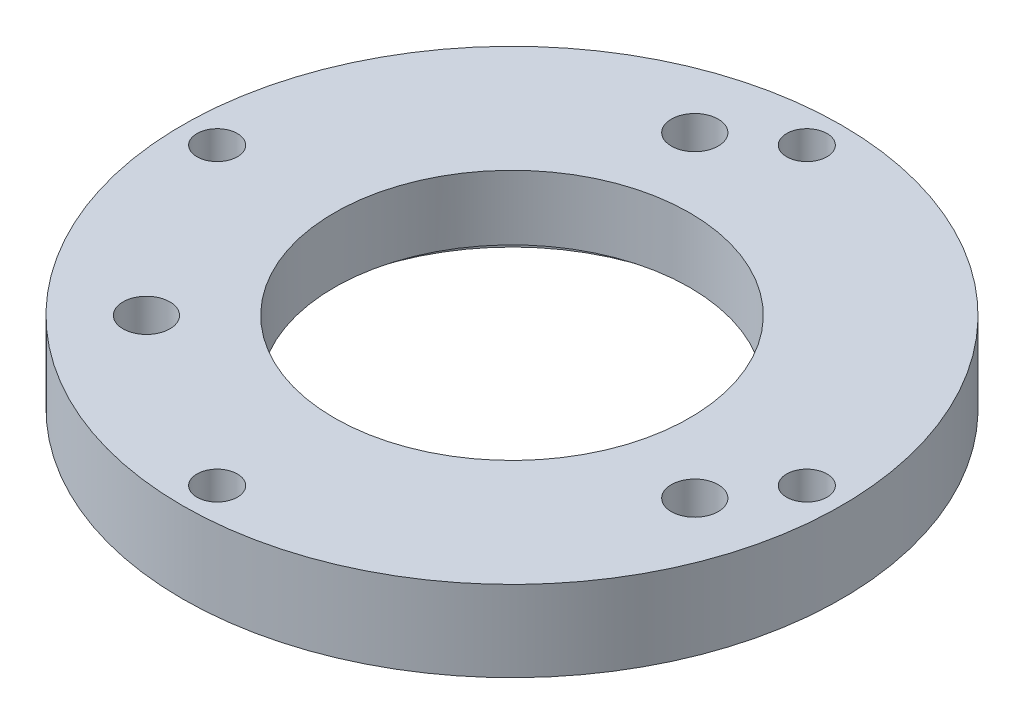
ISO-10303-21;
HEADER;
FILE_DESCRIPTION(('STEP AP214'),'2;1');
FILE_NAME('part.step','',(''),(''),'','','');
FILE_SCHEMA(('AUTOMOTIVE_DESIGN { 1 0 10303 214 1 1 1 1 }'));
ENDSEC;
DATA;
#1=APPLICATION_CONTEXT('core data for automotive mechanical design processes');
#2=APPLICATION_PROTOCOL_DEFINITION('international standard','automotive_design',2000,#1);
#3=PRODUCT_CONTEXT('',#1,'mechanical');
#4=PRODUCT('Part','Part','',(#3));
#5=PRODUCT_RELATED_PRODUCT_CATEGORY('part','',(#4));
#6=PRODUCT_DEFINITION_FORMATION('','',#4);
#7=PRODUCT_DEFINITION_CONTEXT('part definition',#1,'design');
#8=PRODUCT_DEFINITION('design','',#6,#7);
#9=PRODUCT_DEFINITION_SHAPE('','',#8);
#10=(LENGTH_UNIT() NAMED_UNIT(*) SI_UNIT(.MILLI.,.METRE.));
#11=(NAMED_UNIT(*) PLANE_ANGLE_UNIT() SI_UNIT($,.RADIAN.));
#12=(NAMED_UNIT(*) SI_UNIT($,.STERADIAN.) SOLID_ANGLE_UNIT());
#13=UNCERTAINTY_MEASURE_WITH_UNIT(LENGTH_MEASURE(1.E-05),#10,'distance_accuracy_value','');
#14=(GEOMETRIC_REPRESENTATION_CONTEXT(3) GLOBAL_UNCERTAINTY_ASSIGNED_CONTEXT((#13)) GLOBAL_UNIT_ASSIGNED_CONTEXT((#10,
#11,#12)) REPRESENTATION_CONTEXT('',''));
#15=CARTESIAN_POINT('',(0.,0.,0.));
#16=DIRECTION('',(0.,0.,1.));
#17=DIRECTION('',(1.,0.,0.));
#18=AXIS2_PLACEMENT_3D('',#15,#16,#17);
#19=CARTESIAN_POINT('',(0.,5.,0.));
#20=DIRECTION('',(0.,-1.,0.));
#21=DIRECTION('',(0.,0.,-1.));
#22=AXIS2_PLACEMENT_3D('',#19,#20,#21);
#23=CYLINDRICAL_SURFACE('',#22,11.);
#24=CARTESIAN_POINT('',(0.,5.,0.));
#25=DIRECTION('',(0.,1.,0.));
#26=DIRECTION('',(0.,0.,1.));
#27=AXIS2_PLACEMENT_3D('',#24,#25,#26);
#28=CIRCLE('',#27,11.);
#29=CARTESIAN_POINT('',(0.,5.,11.));
#30=VERTEX_POINT('',#29);
#31=EDGE_CURVE('E46',#30,#30,#28,.T.);
#32=ORIENTED_EDGE('',*,*,#31,.T.);
#33=EDGE_LOOP('',(#32));
#34=FACE_BOUND('',#33,.T.);
#35=CARTESIAN_POINT('',(0.,1.,0.));
#36=DIRECTION('',(0.,-1.,0.));
#37=DIRECTION('',(0.,0.,-1.));
#38=AXIS2_PLACEMENT_3D('',#35,#36,#37);
#39=CIRCLE('',#38,11.);
#40=CARTESIAN_POINT('',(0.,1.,-11.));
#41=VERTEX_POINT('',#40);
#42=EDGE_CURVE('E37',#41,#41,#39,.T.);
#43=ORIENTED_EDGE('',*,*,#42,.T.);
#44=EDGE_LOOP('',(#43));
#45=FACE_BOUND('',#44,.T.);
#46=ADVANCED_FACE('F33',(#34,#45),#23,.F.);
#47=CARTESIAN_POINT('',(0.,5.,0.));
#48=DIRECTION('',(0.,1.,0.));
#49=DIRECTION('',(0.,0.,1.));
#50=AXIS2_PLACEMENT_3D('',#47,#48,#49);
#51=PLANE('',#50);
#52=CARTESIAN_POINT('',(-11.3137084989848,5.,11.3137084989848));
#53=DIRECTION('',(0.,-1.,0.));
#54=DIRECTION('',(0.,0.,-1.));
#55=AXIS2_PLACEMENT_3D('',#52,#53,#54);
#56=CIRCLE('',#55,1.45);
#57=CARTESIAN_POINT('',(-11.3137084989848,5.,9.86370849898476));
#58=VERTEX_POINT('',#57);
#59=EDGE_CURVE('E98',#58,#58,#56,.T.);
#60=ORIENTED_EDGE('',*,*,#59,.T.);
#61=EDGE_LOOP('',(#60));
#62=FACE_BOUND('',#61,.T.);
#63=CARTESIAN_POINT('',(-4.14110472164031,5.,-15.4548132206251));
#64=DIRECTION('',(0.,-1.,0.));
#65=DIRECTION('',(0.,0.,-1.));
#66=AXIS2_PLACEMENT_3D('',#63,#64,#65);
#67=CIRCLE('',#66,1.45);
#68=CARTESIAN_POINT('',(-4.14110472164031,5.,-16.9048132206251));
#69=VERTEX_POINT('',#68);
#70=EDGE_CURVE('E86',#69,#69,#67,.T.);
#71=ORIENTED_EDGE('',*,*,#70,.T.);
#72=EDGE_LOOP('',(#71));
#73=FACE_BOUND('',#72,.T.);
#74=CARTESIAN_POINT('',(15.4548132206251,5.,4.14110472164043));
#75=DIRECTION('',(0.,-1.,0.));
#76=DIRECTION('',(0.,0.,-1.));
#77=AXIS2_PLACEMENT_3D('',#74,#75,#76);
#78=CIRCLE('',#77,1.45);
#79=CARTESIAN_POINT('',(15.4548132206251,5.,2.69110472164043));
#80=VERTEX_POINT('',#79);
#81=EDGE_CURVE('E74',#80,#80,#78,.T.);
#82=ORIENTED_EDGE('',*,*,#81,.T.);
#83=EDGE_LOOP('',(#82));
#84=FACE_BOUND('',#83,.T.);
#85=CARTESIAN_POINT('',(-18.25,5.,0.));
#86=DIRECTION('',(0.,1.,0.));
#87=DIRECTION('',(0.,0.,1.));
#88=AXIS2_PLACEMENT_3D('',#85,#86,#87);
#89=CIRCLE('',#88,1.24999999999999);
#90=CARTESIAN_POINT('',(-18.25,5.,1.24999999999999));
#91=VERTEX_POINT('',#90);
#92=EDGE_CURVE('E71',#91,#91,#89,.T.);
#93=ORIENTED_EDGE('',*,*,#92,.F.);
#94=EDGE_LOOP('',(#93));
#95=FACE_BOUND('',#94,.T.);
#96=CARTESIAN_POINT('',(0.,5.,-18.25));
#97=DIRECTION('',(0.,1.,0.));
#98=DIRECTION('',(0.,0.,1.));
#99=AXIS2_PLACEMENT_3D('',#96,#97,#98);
#100=CIRCLE('',#99,1.24999999999999);
#101=CARTESIAN_POINT('',(0.,5.,-17.));
#102=VERTEX_POINT('',#101);
#103=EDGE_CURVE('E65',#102,#102,#100,.T.);
#104=ORIENTED_EDGE('',*,*,#103,.F.);
#105=EDGE_LOOP('',(#104));
#106=FACE_BOUND('',#105,.T.);
#107=CARTESIAN_POINT('',(18.25,5.,0.));
#108=DIRECTION('',(0.,1.,0.));
#109=DIRECTION('',(0.,0.,1.));
#110=AXIS2_PLACEMENT_3D('',#107,#108,#109);
#111=CIRCLE('',#110,1.24999999999999);
#112=CARTESIAN_POINT('',(18.25,5.,1.24999999999999));
#113=VERTEX_POINT('',#112);
#114=EDGE_CURVE('E59',#113,#113,#111,.T.);
#115=ORIENTED_EDGE('',*,*,#114,.F.);
#116=EDGE_LOOP('',(#115));
#117=FACE_BOUND('',#116,.T.);
#118=CARTESIAN_POINT('',(0.,5.,18.25));
#119=DIRECTION('',(0.,1.,0.));
#120=DIRECTION('',(0.,0.,1.));
#121=AXIS2_PLACEMENT_3D('',#118,#119,#120);
#122=CIRCLE('',#121,1.24999999999999);
#123=CARTESIAN_POINT('',(0.,5.,19.5));
#124=VERTEX_POINT('',#123);
#125=EDGE_CURVE('E53',#124,#124,#122,.T.);
#126=ORIENTED_EDGE('',*,*,#125,.F.);
#127=EDGE_LOOP('',(#126));
#128=FACE_BOUND('',#127,.T.);
#129=CARTESIAN_POINT('',(0.,5.,0.));
#130=DIRECTION('',(0.,1.,0.));
#131=DIRECTION('',(0.,0.,1.));
#132=AXIS2_PLACEMENT_3D('',#129,#130,#131);
#133=CIRCLE('',#132,20.4);
#134=CARTESIAN_POINT('',(0.,5.,20.4));
#135=VERTEX_POINT('',#134);
#136=EDGE_CURVE('E10',#135,#135,#133,.T.);
#137=ORIENTED_EDGE('',*,*,#136,.T.);
#138=EDGE_LOOP('',(#137));
#139=FACE_BOUND('',#138,.T.);
#140=ORIENTED_EDGE('',*,*,#31,.F.);
#141=EDGE_LOOP('',(#140));
#142=FACE_BOUND('',#141,.T.);
#143=ADVANCED_FACE('F132',(#62,#73,#84,#95,#106,#117,#128,#139,#142),#51,.T.);
#144=CARTESIAN_POINT('',(0.,0.,0.));
#145=DIRECTION('',(0.,1.,0.));
#146=DIRECTION('',(0.,0.,1.));
#147=AXIS2_PLACEMENT_3D('',#144,#145,#146);
#148=PLANE('',#147);
#149=CARTESIAN_POINT('',(0.,0.,0.));
#150=DIRECTION('',(0.,-1.,0.));
#151=DIRECTION('',(0.,0.,-1.));
#152=AXIS2_PLACEMENT_3D('',#149,#150,#151);
#153=CIRCLE('',#152,12.25);
#154=CARTESIAN_POINT('',(0.,0.,-12.25));
#155=VERTEX_POINT('',#154);
#156=EDGE_CURVE('E110',#155,#155,#153,.T.);
#157=ORIENTED_EDGE('',*,*,#156,.F.);
#158=EDGE_LOOP('',(#157));
#159=FACE_BOUND('',#158,.T.);
#160=CARTESIAN_POINT('',(-11.3137084989848,0.,11.3137084989848));
#161=DIRECTION('',(0.,-1.,0.));
#162=DIRECTION('',(0.,0.,-1.));
#163=AXIS2_PLACEMENT_3D('',#160,#161,#162);
#164=CIRCLE('',#163,2.75);
#165=CARTESIAN_POINT('',(-11.3137084989848,0.,8.56370849898476));
#166=VERTEX_POINT('',#165);
#167=EDGE_CURVE('E107',#166,#166,#164,.T.);
#168=ORIENTED_EDGE('',*,*,#167,.F.);
#169=EDGE_LOOP('',(#168));
#170=FACE_BOUND('',#169,.T.);
#171=CARTESIAN_POINT('',(-4.14110472164031,0.,-15.4548132206251));
#172=DIRECTION('',(0.,-1.,0.));
#173=DIRECTION('',(0.,0.,-1.));
#174=AXIS2_PLACEMENT_3D('',#171,#172,#173);
#175=CIRCLE('',#174,2.75);
#176=CARTESIAN_POINT('',(-4.14110472164031,0.,-18.2048132206251));
#177=VERTEX_POINT('',#176);
#178=EDGE_CURVE('E95',#177,#177,#175,.T.);
#179=ORIENTED_EDGE('',*,*,#178,.F.);
#180=EDGE_LOOP('',(#179));
#181=FACE_BOUND('',#180,.T.);
#182=CARTESIAN_POINT('',(15.4548132206251,0.,4.14110472164043));
#183=DIRECTION('',(0.,-1.,0.));
#184=DIRECTION('',(0.,0.,-1.));
#185=AXIS2_PLACEMENT_3D('',#182,#183,#184);
#186=CIRCLE('',#185,2.75);
#187=CARTESIAN_POINT('',(15.4548132206251,0.,1.39110472164043));
#188=VERTEX_POINT('',#187);
#189=EDGE_CURVE('E83',#188,#188,#186,.T.);
#190=ORIENTED_EDGE('',*,*,#189,.F.);
#191=EDGE_LOOP('',(#190));
#192=FACE_BOUND('',#191,.T.);
#193=CARTESIAN_POINT('',(-18.25,0.,0.));
#194=DIRECTION('',(0.,1.,0.));
#195=DIRECTION('',(0.,0.,1.));
#196=AXIS2_PLACEMENT_3D('',#193,#194,#195);
#197=CIRCLE('',#196,1.25);
#198=CARTESIAN_POINT('',(-18.25,0.,1.25));
#199=VERTEX_POINT('',#198);
#200=EDGE_CURVE('E68',#199,#199,#197,.T.);
#201=ORIENTED_EDGE('',*,*,#200,.T.);
#202=EDGE_LOOP('',(#201));
#203=FACE_BOUND('',#202,.T.);
#204=CARTESIAN_POINT('',(0.,0.,-18.25));
#205=DIRECTION('',(0.,1.,0.));
#206=DIRECTION('',(0.,0.,1.));
#207=AXIS2_PLACEMENT_3D('',#204,#205,#206);
#208=CIRCLE('',#207,1.25);
#209=CARTESIAN_POINT('',(0.,0.,-17.));
#210=VERTEX_POINT('',#209);
#211=EDGE_CURVE('E62',#210,#210,#208,.T.);
#212=ORIENTED_EDGE('',*,*,#211,.T.);
#213=EDGE_LOOP('',(#212));
#214=FACE_BOUND('',#213,.T.);
#215=CARTESIAN_POINT('',(18.25,0.,0.));
#216=DIRECTION('',(0.,1.,0.));
#217=DIRECTION('',(0.,0.,1.));
#218=AXIS2_PLACEMENT_3D('',#215,#216,#217);
#219=CIRCLE('',#218,1.25);
#220=CARTESIAN_POINT('',(18.25,0.,1.25));
#221=VERTEX_POINT('',#220);
#222=EDGE_CURVE('E56',#221,#221,#219,.T.);
#223=ORIENTED_EDGE('',*,*,#222,.T.);
#224=EDGE_LOOP('',(#223));
#225=FACE_BOUND('',#224,.T.);
#226=CARTESIAN_POINT('',(0.,0.,18.25));
#227=DIRECTION('',(0.,1.,0.));
#228=DIRECTION('',(0.,0.,1.));
#229=AXIS2_PLACEMENT_3D('',#226,#227,#228);
#230=CIRCLE('',#229,1.25);
#231=CARTESIAN_POINT('',(0.,0.,19.5));
#232=VERTEX_POINT('',#231);
#233=EDGE_CURVE('E50',#232,#232,#230,.T.);
#234=ORIENTED_EDGE('',*,*,#233,.T.);
#235=EDGE_LOOP('',(#234));
#236=FACE_BOUND('',#235,.T.);
#237=CARTESIAN_POINT('',(0.,0.,0.));
#238=DIRECTION('',(0.,1.,0.));
#239=DIRECTION('',(0.,0.,1.));
#240=AXIS2_PLACEMENT_3D('',#237,#238,#239);
#241=CIRCLE('',#240,20.4);
#242=CARTESIAN_POINT('',(0.,0.,20.4));
#243=VERTEX_POINT('',#242);
#244=EDGE_CURVE('E41',#243,#243,#241,.T.);
#245=ORIENTED_EDGE('',*,*,#244,.F.);
#246=EDGE_LOOP('',(#245));
#247=FACE_BOUND('',#246,.T.);
#248=ADVANCED_FACE('F138',(#159,#170,#181,#192,#203,#214,#225,#236,#247),#148,.F.);
#249=CARTESIAN_POINT('',(0.,5.,0.));
#250=DIRECTION('',(0.,-1.,0.));
#251=DIRECTION('',(0.,0.,-1.));
#252=AXIS2_PLACEMENT_3D('',#249,#250,#251);
#253=CYLINDRICAL_SURFACE('',#252,20.4);
#254=ORIENTED_EDGE('',*,*,#136,.F.);
#255=EDGE_LOOP('',(#254));
#256=FACE_BOUND('',#255,.T.);
#257=ORIENTED_EDGE('',*,*,#244,.T.);
#258=EDGE_LOOP('',(#257));
#259=FACE_BOUND('',#258,.T.);
#260=ADVANCED_FACE('F35',(#256,#259),#253,.T.);
#261=CARTESIAN_POINT('',(0.,5.,18.25));
#262=DIRECTION('',(0.,1.,0.));
#263=DIRECTION('',(0.,0.,1.));
#264=AXIS2_PLACEMENT_3D('',#261,#262,#263);
#265=CYLINDRICAL_SURFACE('',#264,1.24999999999999);
#266=ORIENTED_EDGE('',*,*,#233,.F.);
#267=EDGE_LOOP('',(#266));
#268=FACE_BOUND('',#267,.T.);
#269=ORIENTED_EDGE('',*,*,#125,.T.);
#270=EDGE_LOOP('',(#269));
#271=FACE_BOUND('',#270,.T.);
#272=ADVANCED_FACE('F142',(#268,#271),#265,.F.);
#273=CARTESIAN_POINT('',(18.25,5.,0.));
#274=DIRECTION('',(0.,1.,0.));
#275=DIRECTION('',(0.,0.,1.));
#276=AXIS2_PLACEMENT_3D('',#273,#274,#275);
#277=CYLINDRICAL_SURFACE('',#276,1.24999999999999);
#278=ORIENTED_EDGE('',*,*,#222,.F.);
#279=EDGE_LOOP('',(#278));
#280=FACE_BOUND('',#279,.T.);
#281=ORIENTED_EDGE('',*,*,#114,.T.);
#282=EDGE_LOOP('',(#281));
#283=FACE_BOUND('',#282,.T.);
#284=ADVANCED_FACE('F171',(#280,#283),#277,.F.);
#285=CARTESIAN_POINT('',(0.,5.,-18.25));
#286=DIRECTION('',(0.,1.,0.));
#287=DIRECTION('',(0.,0.,1.));
#288=AXIS2_PLACEMENT_3D('',#285,#286,#287);
#289=CYLINDRICAL_SURFACE('',#288,1.24999999999999);
#290=ORIENTED_EDGE('',*,*,#211,.F.);
#291=EDGE_LOOP('',(#290));
#292=FACE_BOUND('',#291,.T.);
#293=ORIENTED_EDGE('',*,*,#103,.T.);
#294=EDGE_LOOP('',(#293));
#295=FACE_BOUND('',#294,.T.);
#296=ADVANCED_FACE('F179',(#292,#295),#289,.F.);
#297=CARTESIAN_POINT('',(-18.25,5.,0.));
#298=DIRECTION('',(0.,1.,0.));
#299=DIRECTION('',(0.,0.,1.));
#300=AXIS2_PLACEMENT_3D('',#297,#298,#299);
#301=CYLINDRICAL_SURFACE('',#300,1.24999999999999);
#302=ORIENTED_EDGE('',*,*,#200,.F.);
#303=EDGE_LOOP('',(#302));
#304=FACE_BOUND('',#303,.T.);
#305=ORIENTED_EDGE('',*,*,#92,.T.);
#306=EDGE_LOOP('',(#305));
#307=FACE_BOUND('',#306,.T.);
#308=ADVANCED_FACE('F184',(#304,#307),#301,.F.);
#309=CARTESIAN_POINT('',(15.4548132206251,0.,4.14110472164043));
#310=DIRECTION('',(0.,-1.,0.));
#311=DIRECTION('',(0.,0.,-1.));
#312=AXIS2_PLACEMENT_3D('',#309,#310,#311);
#313=CYLINDRICAL_SURFACE('',#312,1.45);
#314=ORIENTED_EDGE('',*,*,#81,.F.);
#315=EDGE_LOOP('',(#314));
#316=FACE_BOUND('',#315,.T.);
#317=CARTESIAN_POINT('',(15.4548132206251,2.5,4.14110472164043));
#318=DIRECTION('',(0.,-1.,0.));
#319=DIRECTION('',(0.,0.,-1.));
#320=AXIS2_PLACEMENT_3D('',#317,#318,#319);
#321=CIRCLE('',#320,1.45);
#322=CARTESIAN_POINT('',(15.4548132206251,2.5,2.69110472164043));
#323=VERTEX_POINT('',#322);
#324=EDGE_CURVE('E77',#323,#323,#321,.T.);
#325=ORIENTED_EDGE('',*,*,#324,.T.);
#326=EDGE_LOOP('',(#325));
#327=FACE_BOUND('',#326,.T.);
#328=ADVANCED_FACE('F191',(#316,#327),#313,.F.);
#329=CARTESIAN_POINT('',(16.9048132206251,2.5,4.14110472164043));
#330=DIRECTION('',(0.,1.,0.));
#331=DIRECTION('',(0.,0.,1.));
#332=AXIS2_PLACEMENT_3D('',#329,#330,#331);
#333=PLANE('',#332);
#334=ORIENTED_EDGE('',*,*,#324,.F.);
#335=EDGE_LOOP('',(#334));
#336=FACE_BOUND('',#335,.T.);
#337=CARTESIAN_POINT('',(15.4548132206251,2.5,4.14110472164043));
#338=DIRECTION('',(0.,-1.,0.));
#339=DIRECTION('',(0.,0.,-1.));
#340=AXIS2_PLACEMENT_3D('',#337,#338,#339);
#341=CIRCLE('',#340,2.75);
#342=CARTESIAN_POINT('',(15.4548132206251,2.5,1.39110472164043));
#343=VERTEX_POINT('',#342);
#344=EDGE_CURVE('E80',#343,#343,#341,.T.);
#345=ORIENTED_EDGE('',*,*,#344,.T.);
#346=EDGE_LOOP('',(#345));
#347=FACE_BOUND('',#346,.T.);
#348=ADVANCED_FACE('F195',(#336,#347),#333,.F.);
#349=CARTESIAN_POINT('',(15.4548132206251,0.,4.14110472164043));
#350=DIRECTION('',(0.,-1.,0.));
#351=DIRECTION('',(0.,0.,-1.));
#352=AXIS2_PLACEMENT_3D('',#349,#350,#351);
#353=CYLINDRICAL_SURFACE('',#352,2.75);
#354=ORIENTED_EDGE('',*,*,#344,.F.);
#355=EDGE_LOOP('',(#354));
#356=FACE_BOUND('',#355,.T.);
#357=ORIENTED_EDGE('',*,*,#189,.T.);
#358=EDGE_LOOP('',(#357));
#359=FACE_BOUND('',#358,.T.);
#360=ADVANCED_FACE('F199',(#356,#359),#353,.F.);
#361=CARTESIAN_POINT('',(-4.14110472164031,0.,-15.4548132206251));
#362=DIRECTION('',(0.,-1.,0.));
#363=DIRECTION('',(0.,0.,-1.));
#364=AXIS2_PLACEMENT_3D('',#361,#362,#363);
#365=CYLINDRICAL_SURFACE('',#364,1.45);
#366=ORIENTED_EDGE('',*,*,#70,.F.);
#367=EDGE_LOOP('',(#366));
#368=FACE_BOUND('',#367,.T.);
#369=CARTESIAN_POINT('',(-4.14110472164031,2.5,-15.4548132206251));
#370=DIRECTION('',(0.,-1.,0.));
#371=DIRECTION('',(0.,0.,-1.));
#372=AXIS2_PLACEMENT_3D('',#369,#370,#371);
#373=CIRCLE('',#372,1.45);
#374=CARTESIAN_POINT('',(-4.14110472164031,2.5,-16.9048132206251));
#375=VERTEX_POINT('',#374);
#376=EDGE_CURVE('E89',#375,#375,#373,.T.);
#377=ORIENTED_EDGE('',*,*,#376,.T.);
#378=EDGE_LOOP('',(#377));
#379=FACE_BOUND('',#378,.T.);
#380=ADVANCED_FACE('F203',(#368,#379),#365,.F.);
#381=CARTESIAN_POINT('',(-2.69110472164031,2.5,-15.4548132206251));
#382=DIRECTION('',(0.,1.,0.));
#383=DIRECTION('',(0.,0.,1.));
#384=AXIS2_PLACEMENT_3D('',#381,#382,#383);
#385=PLANE('',#384);
#386=ORIENTED_EDGE('',*,*,#376,.F.);
#387=EDGE_LOOP('',(#386));
#388=FACE_BOUND('',#387,.T.);
#389=CARTESIAN_POINT('',(-4.14110472164031,2.5,-15.4548132206251));
#390=DIRECTION('',(0.,-1.,0.));
#391=DIRECTION('',(0.,0.,-1.));
#392=AXIS2_PLACEMENT_3D('',#389,#390,#391);
#393=CIRCLE('',#392,2.75);
#394=CARTESIAN_POINT('',(-4.14110472164031,2.5,-18.2048132206251));
#395=VERTEX_POINT('',#394);
#396=EDGE_CURVE('E92',#395,#395,#393,.T.);
#397=ORIENTED_EDGE('',*,*,#396,.T.);
#398=EDGE_LOOP('',(#397));
#399=FACE_BOUND('',#398,.T.);
#400=ADVANCED_FACE('F207',(#388,#399),#385,.F.);
#401=CARTESIAN_POINT('',(-4.14110472164031,0.,-15.4548132206251));
#402=DIRECTION('',(0.,-1.,0.));
#403=DIRECTION('',(0.,0.,-1.));
#404=AXIS2_PLACEMENT_3D('',#401,#402,#403);
#405=CYLINDRICAL_SURFACE('',#404,2.75);
#406=ORIENTED_EDGE('',*,*,#396,.F.);
#407=EDGE_LOOP('',(#406));
#408=FACE_BOUND('',#407,.T.);
#409=ORIENTED_EDGE('',*,*,#178,.T.);
#410=EDGE_LOOP('',(#409));
#411=FACE_BOUND('',#410,.T.);
#412=ADVANCED_FACE('F211',(#408,#411),#405,.F.);
#413=CARTESIAN_POINT('',(-11.3137084989848,0.,11.3137084989848));
#414=DIRECTION('',(0.,-1.,0.));
#415=DIRECTION('',(0.,0.,-1.));
#416=AXIS2_PLACEMENT_3D('',#413,#414,#415);
#417=CYLINDRICAL_SURFACE('',#416,1.45);
#418=ORIENTED_EDGE('',*,*,#59,.F.);
#419=EDGE_LOOP('',(#418));
#420=FACE_BOUND('',#419,.T.);
#421=CARTESIAN_POINT('',(-11.3137084989848,2.5,11.3137084989848));
#422=DIRECTION('',(0.,-1.,0.));
#423=DIRECTION('',(0.,0.,-1.));
#424=AXIS2_PLACEMENT_3D('',#421,#422,#423);
#425=CIRCLE('',#424,1.45);
#426=CARTESIAN_POINT('',(-11.3137084989848,2.5,9.86370849898476));
#427=VERTEX_POINT('',#426);
#428=EDGE_CURVE('E101',#427,#427,#425,.T.);
#429=ORIENTED_EDGE('',*,*,#428,.T.);
#430=EDGE_LOOP('',(#429));
#431=FACE_BOUND('',#430,.T.);
#432=ADVANCED_FACE('F215',(#420,#431),#417,.F.);
#433=CARTESIAN_POINT('',(-9.86370849898476,2.5,11.3137084989848));
#434=DIRECTION('',(0.,1.,0.));
#435=DIRECTION('',(0.,0.,1.));
#436=AXIS2_PLACEMENT_3D('',#433,#434,#435);
#437=PLANE('',#436);
#438=ORIENTED_EDGE('',*,*,#428,.F.);
#439=EDGE_LOOP('',(#438));
#440=FACE_BOUND('',#439,.T.);
#441=CARTESIAN_POINT('',(-11.3137084989848,2.5,11.3137084989848));
#442=DIRECTION('',(0.,-1.,0.));
#443=DIRECTION('',(0.,0.,-1.));
#444=AXIS2_PLACEMENT_3D('',#441,#442,#443);
#445=CIRCLE('',#444,2.75);
#446=CARTESIAN_POINT('',(-11.3137084989848,2.5,8.56370849898476));
#447=VERTEX_POINT('',#446);
#448=EDGE_CURVE('E104',#447,#447,#445,.T.);
#449=ORIENTED_EDGE('',*,*,#448,.T.);
#450=EDGE_LOOP('',(#449));
#451=FACE_BOUND('',#450,.T.);
#452=ADVANCED_FACE('F219',(#440,#451),#437,.F.);
#453=CARTESIAN_POINT('',(-11.3137084989848,0.,11.3137084989848));
#454=DIRECTION('',(0.,-1.,0.));
#455=DIRECTION('',(0.,0.,-1.));
#456=AXIS2_PLACEMENT_3D('',#453,#454,#455);
#457=CYLINDRICAL_SURFACE('',#456,2.75);
#458=ORIENTED_EDGE('',*,*,#448,.F.);
#459=EDGE_LOOP('',(#458));
#460=FACE_BOUND('',#459,.T.);
#461=ORIENTED_EDGE('',*,*,#167,.T.);
#462=EDGE_LOOP('',(#461));
#463=FACE_BOUND('',#462,.T.);
#464=ADVANCED_FACE('F128',(#460,#463),#457,.F.);
#465=CARTESIAN_POINT('',(0.,1.,0.));
#466=DIRECTION('',(0.,-1.,0.));
#467=DIRECTION('',(0.,0.,-1.));
#468=AXIS2_PLACEMENT_3D('',#465,#466,#467);
#469=CYLINDRICAL_SURFACE('',#468,12.25);
#470=CARTESIAN_POINT('',(0.,1.,0.));
#471=DIRECTION('',(0.,-1.,0.));
#472=DIRECTION('',(0.,0.,-1.));
#473=AXIS2_PLACEMENT_3D('',#470,#471,#472);
#474=CIRCLE('',#473,12.25);
#475=CARTESIAN_POINT('',(0.,1.,-12.25));
#476=VERTEX_POINT('',#475);
#477=EDGE_CURVE('E113',#476,#476,#474,.T.);
#478=ORIENTED_EDGE('',*,*,#477,.F.);
#479=EDGE_LOOP('',(#478));
#480=FACE_BOUND('',#479,.T.);
#481=ORIENTED_EDGE('',*,*,#156,.T.);
#482=EDGE_LOOP('',(#481));
#483=FACE_BOUND('',#482,.T.);
#484=ADVANCED_FACE('F123',(#480,#483),#469,.F.);
#485=CARTESIAN_POINT('',(0.,1.,0.));
#486=DIRECTION('',(0.,-1.,0.));
#487=DIRECTION('',(0.,0.,-1.));
#488=AXIS2_PLACEMENT_3D('',#485,#486,#487);
#489=PLANE('',#488);
#490=ORIENTED_EDGE('',*,*,#42,.F.);
#491=EDGE_LOOP('',(#490));
#492=FACE_BOUND('',#491,.T.);
#493=ORIENTED_EDGE('',*,*,#477,.T.);
#494=EDGE_LOOP('',(#493));
#495=FACE_BOUND('',#494,.T.);
#496=ADVANCED_FACE('F121',(#492,#495),#489,.T.);
#497=CLOSED_SHELL('',(#46,#143,#248,#260,#272,#284,#296,#308,#328,#348,#360,#380,#400,#412,#432,
#452,#464,#484,#496));
#498=MANIFOLD_SOLID_BREP('B2',#497);
#499=ADVANCED_BREP_SHAPE_REPRESENTATION('',(#18,#498),#14);
#500=SHAPE_DEFINITION_REPRESENTATION(#9,#499);
ENDSEC;
END-ISO-10303-21;
